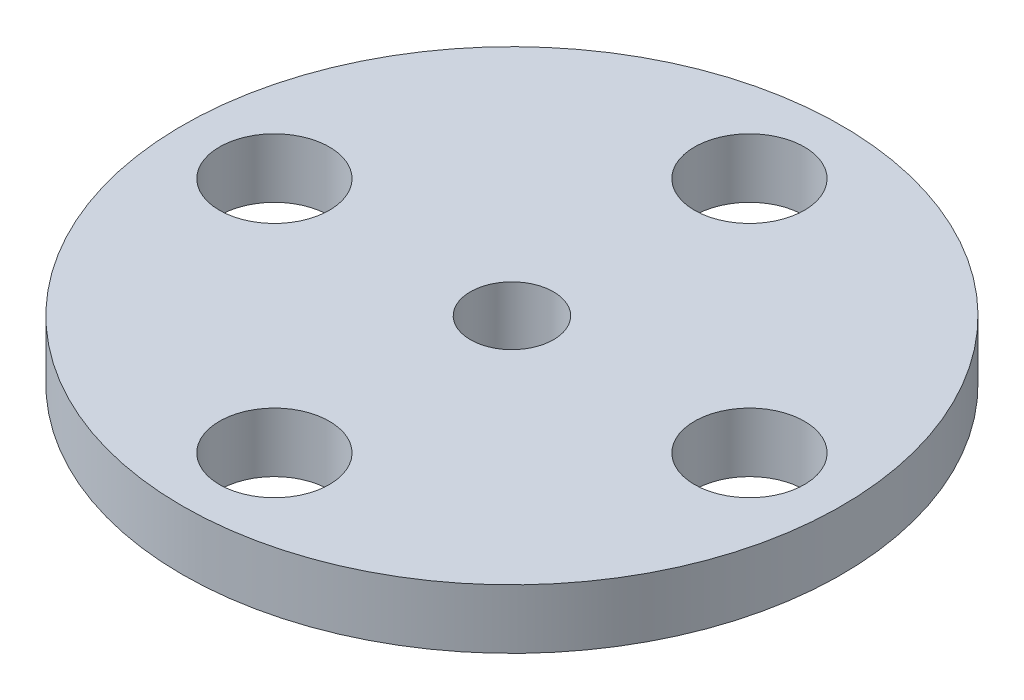
ISO-10303-21;
HEADER;
FILE_DESCRIPTION(('STEP AP214'),'2;1');
FILE_NAME('part.step','',(''),(''),'','','');
FILE_SCHEMA(('AUTOMOTIVE_DESIGN { 1 0 10303 214 1 1 1 1 }'));
ENDSEC;
DATA;
#1=APPLICATION_CONTEXT('core data for automotive mechanical design processes');
#2=APPLICATION_PROTOCOL_DEFINITION('international standard','automotive_design',2000,#1);
#3=PRODUCT_CONTEXT('',#1,'mechanical');
#4=PRODUCT('Part','Part','',(#3));
#5=PRODUCT_RELATED_PRODUCT_CATEGORY('part','',(#4));
#6=PRODUCT_DEFINITION_FORMATION('','',#4);
#7=PRODUCT_DEFINITION_CONTEXT('part definition',#1,'design');
#8=PRODUCT_DEFINITION('design','',#6,#7);
#9=PRODUCT_DEFINITION_SHAPE('','',#8);
#10=(LENGTH_UNIT() NAMED_UNIT(*) SI_UNIT(.MILLI.,.METRE.));
#11=(NAMED_UNIT(*) PLANE_ANGLE_UNIT() SI_UNIT($,.RADIAN.));
#12=(NAMED_UNIT(*) SI_UNIT($,.STERADIAN.) SOLID_ANGLE_UNIT());
#13=UNCERTAINTY_MEASURE_WITH_UNIT(LENGTH_MEASURE(1.E-05),#10,'distance_accuracy_value','');
#14=(GEOMETRIC_REPRESENTATION_CONTEXT(3) GLOBAL_UNCERTAINTY_ASSIGNED_CONTEXT((#13)) GLOBAL_UNIT_ASSIGNED_CONTEXT((#10,
#11,#12)) REPRESENTATION_CONTEXT('',''));
#15=CARTESIAN_POINT('',(0.,0.,0.));
#16=DIRECTION('',(0.,0.,1.));
#17=DIRECTION('',(1.,0.,0.));
#18=AXIS2_PLACEMENT_3D('',#15,#16,#17);
#19=CARTESIAN_POINT('',(-45.1927406506343,20.5638203494151,10.624161016608));
#20=DIRECTION('',(0.,1.,0.));
#21=DIRECTION('',(0.,0.,1.));
#22=AXIS2_PLACEMENT_3D('',#19,#20,#21);
#23=PLANE('',#22);
#24=CARTESIAN_POINT('',(-45.1927406506343,20.5638203494151,18.624161016608));
#25=DIRECTION('',(0.,1.,0.));
#26=DIRECTION('',(0.,0.,1.));
#27=AXIS2_PLACEMENT_3D('',#24,#25,#26);
#28=CIRCLE('',#27,1.85);
#29=CARTESIAN_POINT('',(-45.1927406506343,20.5638203494151,20.474161016608));
#30=VERTEX_POINT('',#29);
#31=EDGE_CURVE('E78',#30,#30,#28,.F.);
#32=ORIENTED_EDGE('',*,*,#31,.F.);
#33=EDGE_LOOP('',(#32));
#34=FACE_BOUND('',#33,.T.);
#35=CARTESIAN_POINT('',(-37.1927406506343,20.5638203494151,10.624161016608));
#36=DIRECTION('',(0.,1.,0.));
#37=DIRECTION('',(0.,0.,1.));
#38=AXIS2_PLACEMENT_3D('',#35,#36,#37);
#39=CIRCLE('',#38,1.85);
#40=CARTESIAN_POINT('',(-37.1927406506343,20.5638203494151,12.474161016608));
#41=VERTEX_POINT('',#40);
#42=EDGE_CURVE('E70',#41,#41,#39,.F.);
#43=ORIENTED_EDGE('',*,*,#42,.F.);
#44=EDGE_LOOP('',(#43));
#45=FACE_BOUND('',#44,.T.);
#46=CARTESIAN_POINT('',(-45.1927406506343,20.5638203494151,2.62416101660801));
#47=DIRECTION('',(0.,1.,0.));
#48=DIRECTION('',(0.,0.,1.));
#49=AXIS2_PLACEMENT_3D('',#46,#47,#48);
#50=CIRCLE('',#49,1.85);
#51=CARTESIAN_POINT('',(-45.1927406506343,20.5638203494151,4.47416101660801));
#52=VERTEX_POINT('',#51);
#53=EDGE_CURVE('E62',#52,#52,#50,.F.);
#54=ORIENTED_EDGE('',*,*,#53,.F.);
#55=EDGE_LOOP('',(#54));
#56=FACE_BOUND('',#55,.T.);
#57=CARTESIAN_POINT('',(-53.1927406506343,20.5638203494151,10.624161016608));
#58=DIRECTION('',(0.,1.,0.));
#59=DIRECTION('',(0.,0.,1.));
#60=AXIS2_PLACEMENT_3D('',#57,#58,#59);
#61=CIRCLE('',#60,1.85);
#62=CARTESIAN_POINT('',(-53.1927406506343,20.5638203494151,12.474161016608));
#63=VERTEX_POINT('',#62);
#64=EDGE_CURVE('E54',#63,#63,#61,.F.);
#65=ORIENTED_EDGE('',*,*,#64,.F.);
#66=EDGE_LOOP('',(#65));
#67=FACE_BOUND('',#66,.T.);
#68=CARTESIAN_POINT('',(-45.1927406506343,20.5638203494232,10.624161016608));
#69=DIRECTION('',(0.,1.,0.));
#70=DIRECTION('',(0.,0.,1.));
#71=AXIS2_PLACEMENT_3D('',#68,#69,#70);
#72=CIRCLE('',#71,4.45);
#73=CARTESIAN_POINT('',(-45.1927406506343,20.5638203494232,15.074161016608));
#74=VERTEX_POINT('',#73);
#75=EDGE_CURVE('E29',#74,#74,#72,.F.);
#76=ORIENTED_EDGE('',*,*,#75,.F.);
#77=EDGE_LOOP('',(#76));
#78=FACE_BOUND('',#77,.T.);
#79=CARTESIAN_POINT('',(-45.1927406506343,20.5638203494151,10.624161016608));
#80=DIRECTION('',(0.,1.,0.));
#81=DIRECTION('',(0.,0.,1.));
#82=AXIS2_PLACEMENT_3D('',#79,#80,#81);
#83=CIRCLE('',#82,11.1);
#84=CARTESIAN_POINT('',(-45.1927406506343,20.5638203494151,21.724161016608));
#85=VERTEX_POINT('',#84);
#86=EDGE_CURVE('E18',#85,#85,#83,.T.);
#87=ORIENTED_EDGE('',*,*,#86,.F.);
#88=EDGE_LOOP('',(#87));
#89=FACE_BOUND('',#88,.T.);
#90=ADVANCED_FACE('F14',(#34,#45,#56,#67,#78,#89),#23,.F.);
#91=CARTESIAN_POINT('',(-45.1927406506343,22.5638203494151,10.624161016608));
#92=DIRECTION('',(0.,-1.,0.));
#93=DIRECTION('',(0.,0.,-1.));
#94=AXIS2_PLACEMENT_3D('',#91,#92,#93);
#95=CYLINDRICAL_SURFACE('',#94,11.1);
#96=CARTESIAN_POINT('',(-45.1927406506343,22.5638203494151,10.624161016608));
#97=DIRECTION('',(0.,1.,0.));
#98=DIRECTION('',(0.,0.,1.));
#99=AXIS2_PLACEMENT_3D('',#96,#97,#98);
#100=CIRCLE('',#99,11.1);
#101=CARTESIAN_POINT('',(-45.1927406506343,22.5638203494151,21.724161016608));
#102=VERTEX_POINT('',#101);
#103=EDGE_CURVE('E9',#102,#102,#100,.T.);
#104=ORIENTED_EDGE('',*,*,#103,.F.);
#105=EDGE_LOOP('',(#104));
#106=FACE_BOUND('',#105,.T.);
#107=ORIENTED_EDGE('',*,*,#86,.T.);
#108=EDGE_LOOP('',(#107));
#109=FACE_BOUND('',#108,.T.);
#110=ADVANCED_FACE('F16',(#106,#109),#95,.T.);
#111=CARTESIAN_POINT('',(-45.1927406506343,22.5638203494151,10.624161016608));
#112=DIRECTION('',(0.,1.,0.));
#113=DIRECTION('',(0.,0.,1.));
#114=AXIS2_PLACEMENT_3D('',#111,#112,#113);
#115=PLANE('',#114);
#116=CARTESIAN_POINT('',(-45.1927406506343,22.5638203494151,18.624161016608));
#117=DIRECTION('',(0.,1.,0.));
#118=DIRECTION('',(0.,0.,1.));
#119=AXIS2_PLACEMENT_3D('',#116,#117,#118);
#120=CIRCLE('',#119,1.85);
#121=CARTESIAN_POINT('',(-45.1927406506343,22.5638203494151,20.474161016608));
#122=VERTEX_POINT('',#121);
#123=EDGE_CURVE('E82',#122,#122,#120,.T.);
#124=ORIENTED_EDGE('',*,*,#123,.F.);
#125=EDGE_LOOP('',(#124));
#126=FACE_BOUND('',#125,.T.);
#127=CARTESIAN_POINT('',(-37.1927406506343,22.5638203494151,10.624161016608));
#128=DIRECTION('',(0.,1.,0.));
#129=DIRECTION('',(0.,0.,1.));
#130=AXIS2_PLACEMENT_3D('',#127,#128,#129);
#131=CIRCLE('',#130,1.85);
#132=CARTESIAN_POINT('',(-37.1927406506343,22.5638203494151,12.474161016608));
#133=VERTEX_POINT('',#132);
#134=EDGE_CURVE('E74',#133,#133,#131,.T.);
#135=ORIENTED_EDGE('',*,*,#134,.F.);
#136=EDGE_LOOP('',(#135));
#137=FACE_BOUND('',#136,.T.);
#138=CARTESIAN_POINT('',(-45.1927406506343,22.5638203494151,2.62416101660801));
#139=DIRECTION('',(0.,1.,0.));
#140=DIRECTION('',(0.,0.,1.));
#141=AXIS2_PLACEMENT_3D('',#138,#139,#140);
#142=CIRCLE('',#141,1.85);
#143=CARTESIAN_POINT('',(-45.1927406506343,22.5638203494151,4.47416101660801));
#144=VERTEX_POINT('',#143);
#145=EDGE_CURVE('E66',#144,#144,#142,.T.);
#146=ORIENTED_EDGE('',*,*,#145,.F.);
#147=EDGE_LOOP('',(#146));
#148=FACE_BOUND('',#147,.T.);
#149=CARTESIAN_POINT('',(-53.1927406506343,22.5638203494151,10.624161016608));
#150=DIRECTION('',(0.,1.,0.));
#151=DIRECTION('',(0.,0.,1.));
#152=AXIS2_PLACEMENT_3D('',#149,#150,#151);
#153=CIRCLE('',#152,1.85);
#154=CARTESIAN_POINT('',(-53.1927406506343,22.5638203494151,12.474161016608));
#155=VERTEX_POINT('',#154);
#156=EDGE_CURVE('E58',#155,#155,#153,.T.);
#157=ORIENTED_EDGE('',*,*,#156,.F.);
#158=EDGE_LOOP('',(#157));
#159=FACE_BOUND('',#158,.T.);
#160=CARTESIAN_POINT('',(-45.1927406506343,22.5638203494151,10.624161016608));
#161=DIRECTION('',(0.,1.,0.));
#162=DIRECTION('',(0.,0.,1.));
#163=AXIS2_PLACEMENT_3D('',#160,#161,#162);
#164=CIRCLE('',#163,1.4);
#165=CARTESIAN_POINT('',(-45.1927406506343,22.5638203494151,12.024161016608));
#166=VERTEX_POINT('',#165);
#167=EDGE_CURVE('E46',#166,#166,#164,.T.);
#168=ORIENTED_EDGE('',*,*,#167,.F.);
#169=EDGE_LOOP('',(#168));
#170=FACE_BOUND('',#169,.T.);
#171=ORIENTED_EDGE('',*,*,#103,.T.);
#172=EDGE_LOOP('',(#171));
#173=FACE_BOUND('',#172,.T.);
#174=ADVANCED_FACE('F94',(#126,#137,#148,#159,#170,#173),#115,.T.);
#175=CARTESIAN_POINT('',(-45.1927406506343,16.3638203494151,10.624161016608));
#176=DIRECTION('',(0.,-1.,0.));
#177=DIRECTION('',(0.,0.,-1.));
#178=AXIS2_PLACEMENT_3D('',#175,#176,#177);
#179=PLANE('',#178);
#180=CARTESIAN_POINT('',(-45.1927406506343,16.3638203494151,10.624161016608));
#181=DIRECTION('',(0.,-1.,0.));
#182=DIRECTION('',(0.,0.,-1.));
#183=AXIS2_PLACEMENT_3D('',#180,#181,#182);
#184=CIRCLE('',#183,2.85);
#185=CARTESIAN_POINT('',(-45.1927406506343,16.3638203494151,7.77416101660801));
#186=VERTEX_POINT('',#185);
#187=EDGE_CURVE('E50',#186,#186,#184,.T.);
#188=ORIENTED_EDGE('',*,*,#187,.F.);
#189=EDGE_LOOP('',(#188));
#190=FACE_BOUND('',#189,.T.);
#191=CARTESIAN_POINT('',(-45.1927406506343,16.3638203494151,10.624161016608));
#192=DIRECTION('',(0.,-1.,0.));
#193=DIRECTION('',(0.,0.,-1.));
#194=AXIS2_PLACEMENT_3D('',#191,#192,#193);
#195=CIRCLE('',#194,4.45);
#196=CARTESIAN_POINT('',(-45.1927406506343,16.3638203494151,6.17416101660801));
#197=VERTEX_POINT('',#196);
#198=EDGE_CURVE('E34',#197,#197,#195,.T.);
#199=ORIENTED_EDGE('',*,*,#198,.T.);
#200=EDGE_LOOP('',(#199));
#201=FACE_BOUND('',#200,.T.);
#202=ADVANCED_FACE('F97',(#190,#201),#179,.T.);
#203=CARTESIAN_POINT('',(-45.1927406506343,500000.,10.624161016608));
#204=DIRECTION('',(0.,-1.,0.));
#205=DIRECTION('',(0.,0.,-1.));
#206=AXIS2_PLACEMENT_3D('',#203,#204,#205);
#207=CYLINDRICAL_SURFACE('',#206,4.45);
#208=ORIENTED_EDGE('',*,*,#198,.F.);
#209=EDGE_LOOP('',(#208));
#210=FACE_BOUND('',#209,.T.);
#211=ORIENTED_EDGE('',*,*,#75,.T.);
#212=EDGE_LOOP('',(#211));
#213=FACE_BOUND('',#212,.T.);
#214=ADVANCED_FACE('F111',(#210,#213),#207,.T.);
#215=CARTESIAN_POINT('',(-45.1927406506343,14.4140728811093,10.624161016608));
#216=DIRECTION('',(0.,1.,0.));
#217=DIRECTION('',(0.,0.,1.));
#218=AXIS2_PLACEMENT_3D('',#215,#216,#217);
#219=CYLINDRICAL_SURFACE('',#218,1.4);
#220=ORIENTED_EDGE('',*,*,#167,.T.);
#221=EDGE_LOOP('',(#220));
#222=FACE_BOUND('',#221,.T.);
#223=CARTESIAN_POINT('',(-45.1927406506343,19.3638203494151,10.624161016608));
#224=DIRECTION('',(0.,-1.,0.));
#225=DIRECTION('',(0.,0.,-1.));
#226=AXIS2_PLACEMENT_3D('',#223,#224,#225);
#227=CIRCLE('',#226,1.4);
#228=CARTESIAN_POINT('',(-45.1927406506343,19.3638203494151,9.22416101660802));
#229=VERTEX_POINT('',#228);
#230=EDGE_CURVE('E38',#229,#229,#227,.F.);
#231=ORIENTED_EDGE('',*,*,#230,.F.);
#232=EDGE_LOOP('',(#231));
#233=FACE_BOUND('',#232,.T.);
#234=ADVANCED_FACE('F107',(#222,#233),#219,.F.);
#235=CARTESIAN_POINT('',(-45.1927406506343,19.3638203494151,10.624161016608));
#236=DIRECTION('',(0.,-1.,0.));
#237=DIRECTION('',(0.,0.,-1.));
#238=AXIS2_PLACEMENT_3D('',#235,#236,#237);
#239=PLANE('',#238);
#240=CARTESIAN_POINT('',(-45.1927406506343,19.3638203494151,10.624161016608));
#241=DIRECTION('',(0.,-1.,0.));
#242=DIRECTION('',(0.,0.,-1.));
#243=AXIS2_PLACEMENT_3D('',#240,#241,#242);
#244=CIRCLE('',#243,2.85);
#245=CARTESIAN_POINT('',(-45.1927406506343,19.3638203494151,7.77416101660801));
#246=VERTEX_POINT('',#245);
#247=EDGE_CURVE('E42',#246,#246,#244,.T.);
#248=ORIENTED_EDGE('',*,*,#247,.T.);
#249=EDGE_LOOP('',(#248));
#250=FACE_BOUND('',#249,.T.);
#251=ORIENTED_EDGE('',*,*,#230,.T.);
#252=EDGE_LOOP('',(#251));
#253=FACE_BOUND('',#252,.T.);
#254=ADVANCED_FACE('F110',(#250,#253),#239,.T.);
#255=CARTESIAN_POINT('',(-45.1927406506343,19.3638203494151,10.624161016608));
#256=DIRECTION('',(0.,-1.,0.));
#257=DIRECTION('',(0.,0.,-1.));
#258=AXIS2_PLACEMENT_3D('',#255,#256,#257);
#259=CYLINDRICAL_SURFACE('',#258,2.85);
#260=ORIENTED_EDGE('',*,*,#247,.F.);
#261=EDGE_LOOP('',(#260));
#262=FACE_BOUND('',#261,.T.);
#263=ORIENTED_EDGE('',*,*,#187,.T.);
#264=EDGE_LOOP('',(#263));
#265=FACE_BOUND('',#264,.T.);
#266=ADVANCED_FACE('F116',(#262,#265),#259,.F.);
#267=CARTESIAN_POINT('',(-53.1927406506343,16.3628203494151,10.624161016608));
#268=DIRECTION('',(0.,1.,0.));
#269=DIRECTION('',(0.,0.,1.));
#270=AXIS2_PLACEMENT_3D('',#267,#268,#269);
#271=CYLINDRICAL_SURFACE('',#270,1.85);
#272=ORIENTED_EDGE('',*,*,#156,.T.);
#273=EDGE_LOOP('',(#272));
#274=FACE_BOUND('',#273,.T.);
#275=ORIENTED_EDGE('',*,*,#64,.T.);
#276=EDGE_LOOP('',(#275));
#277=FACE_BOUND('',#276,.T.);
#278=ADVANCED_FACE('F123',(#274,#277),#271,.F.);
#279=CARTESIAN_POINT('',(-45.1927406506343,16.3628203494151,2.62416101660801));
#280=DIRECTION('',(0.,1.,0.));
#281=DIRECTION('',(0.,0.,1.));
#282=AXIS2_PLACEMENT_3D('',#279,#280,#281);
#283=CYLINDRICAL_SURFACE('',#282,1.85);
#284=ORIENTED_EDGE('',*,*,#145,.T.);
#285=EDGE_LOOP('',(#284));
#286=FACE_BOUND('',#285,.T.);
#287=ORIENTED_EDGE('',*,*,#53,.T.);
#288=EDGE_LOOP('',(#287));
#289=FACE_BOUND('',#288,.T.);
#290=ADVANCED_FACE('F188',(#286,#289),#283,.F.);
#291=CARTESIAN_POINT('',(-37.1927406506343,16.3628203494151,10.624161016608));
#292=DIRECTION('',(0.,1.,0.));
#293=DIRECTION('',(0.,0.,1.));
#294=AXIS2_PLACEMENT_3D('',#291,#292,#293);
#295=CYLINDRICAL_SURFACE('',#294,1.85);
#296=ORIENTED_EDGE('',*,*,#134,.T.);
#297=EDGE_LOOP('',(#296));
#298=FACE_BOUND('',#297,.T.);
#299=ORIENTED_EDGE('',*,*,#42,.T.);
#300=EDGE_LOOP('',(#299));
#301=FACE_BOUND('',#300,.T.);
#302=ADVANCED_FACE('F197',(#298,#301),#295,.F.);
#303=CARTESIAN_POINT('',(-45.1927406506343,16.3628203494151,18.624161016608));
#304=DIRECTION('',(0.,1.,0.));
#305=DIRECTION('',(0.,0.,1.));
#306=AXIS2_PLACEMENT_3D('',#303,#304,#305);
#307=CYLINDRICAL_SURFACE('',#306,1.85);
#308=ORIENTED_EDGE('',*,*,#123,.T.);
#309=EDGE_LOOP('',(#308));
#310=FACE_BOUND('',#309,.T.);
#311=ORIENTED_EDGE('',*,*,#31,.T.);
#312=EDGE_LOOP('',(#311));
#313=FACE_BOUND('',#312,.T.);
#314=ADVANCED_FACE('F91',(#310,#313),#307,.F.);
#315=CLOSED_SHELL('',(#90,#110,#174,#202,#214,#234,#254,#266,#278,#290,#302,#314));
#316=MANIFOLD_SOLID_BREP('B1',#315);
#317=ADVANCED_BREP_SHAPE_REPRESENTATION('',(#18,#316),#14);
#318=SHAPE_DEFINITION_REPRESENTATION(#9,#317);
ENDSEC;
END-ISO-10303-21;
